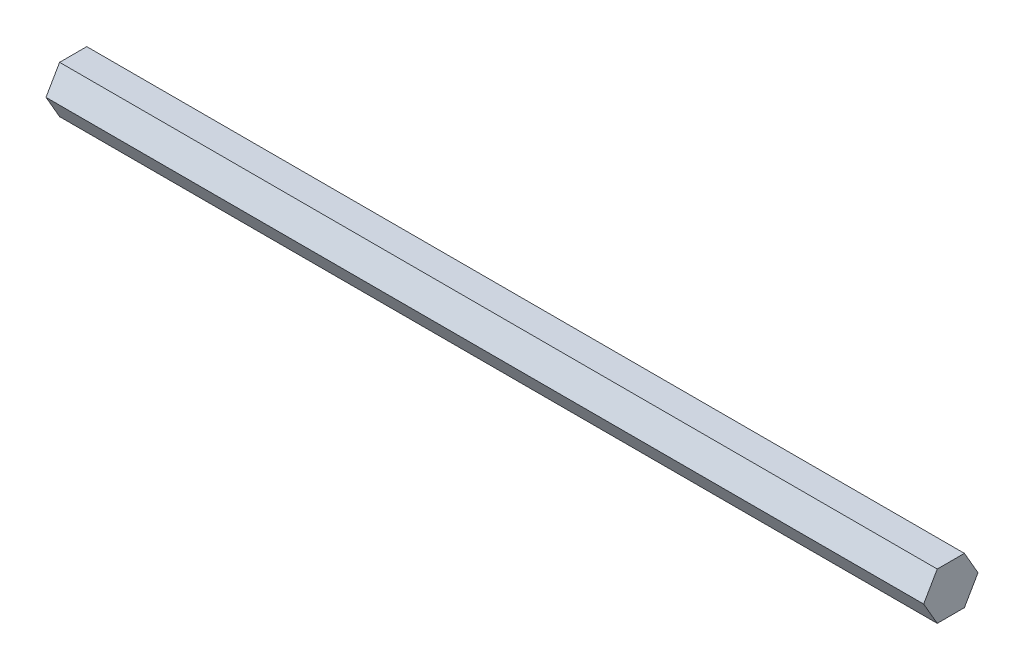
ISO-10303-21;
HEADER;
FILE_DESCRIPTION(('STEP AP214'),'2;1');
FILE_NAME('part.step','',(''),(''),'','','');
FILE_SCHEMA(('AUTOMOTIVE_DESIGN { 1 0 10303 214 1 1 1 1 }'));
ENDSEC;
DATA;
#1=APPLICATION_CONTEXT('core data for automotive mechanical design processes');
#2=APPLICATION_PROTOCOL_DEFINITION('international standard','automotive_design',2000,#1);
#3=PRODUCT_CONTEXT('',#1,'mechanical');
#4=PRODUCT('Part','Part','',(#3));
#5=PRODUCT_RELATED_PRODUCT_CATEGORY('part','',(#4));
#6=PRODUCT_DEFINITION_FORMATION('','',#4);
#7=PRODUCT_DEFINITION_CONTEXT('part definition',#1,'design');
#8=PRODUCT_DEFINITION('design','',#6,#7);
#9=PRODUCT_DEFINITION_SHAPE('','',#8);
#10=(LENGTH_UNIT() NAMED_UNIT(*) SI_UNIT(.MILLI.,.METRE.));
#11=(NAMED_UNIT(*) PLANE_ANGLE_UNIT() SI_UNIT($,.RADIAN.));
#12=(NAMED_UNIT(*) SI_UNIT($,.STERADIAN.) SOLID_ANGLE_UNIT());
#13=UNCERTAINTY_MEASURE_WITH_UNIT(LENGTH_MEASURE(1.E-05),#10,'distance_accuracy_value','');
#14=(GEOMETRIC_REPRESENTATION_CONTEXT(3) GLOBAL_UNCERTAINTY_ASSIGNED_CONTEXT((#13)) GLOBAL_UNIT_ASSIGNED_CONTEXT((#10,
#11,#12)) REPRESENTATION_CONTEXT('',''));
#15=CARTESIAN_POINT('',(0.,0.,0.));
#16=DIRECTION('',(0.,0.,1.));
#17=DIRECTION('',(1.,0.,0.));
#18=AXIS2_PLACEMENT_3D('',#15,#16,#17);
#19=CARTESIAN_POINT('',(236.85,-6.34999999999996,-3.6661742093542));
#20=DIRECTION('',(0.,0.499999999999995,0.866025403784442));
#21=DIRECTION('',(0.,-0.866025403784442,0.499999999999995));
#22=AXIS2_PLACEMENT_3D('',#19,#20,#21);
#23=PLANE('',#22);
#24=DIRECTION('',(0.,0.866025403784442,-0.499999999999995));
#25=VECTOR('',#24,1.);
#26=CARTESIAN_POINT('',(0.,-6.34999999999996,-3.6661742093542));
#27=LINE('',#26,#25);
#28=CARTESIAN_POINT('',(0.,-6.34999999999996,-3.6661742093542));
#29=VERTEX_POINT('',#28);
#30=CARTESIAN_POINT('',(0.,0.,-7.33234841870825));
#31=VERTEX_POINT('',#30);
#32=EDGE_CURVE('E123',#29,#31,#27,.T.);
#33=ORIENTED_EDGE('',*,*,#32,.T.);
#34=DIRECTION('',(-1.,0.,0.));
#35=VECTOR('',#34,1.);
#36=CARTESIAN_POINT('',(236.85,0.,-7.33234841870825));
#37=LINE('',#36,#35);
#38=CARTESIAN_POINT('',(236.85,0.,-7.33234841870825));
#39=VERTEX_POINT('',#38);
#40=EDGE_CURVE('E11',#39,#31,#37,.T.);
#41=ORIENTED_EDGE('',*,*,#40,.F.);
#42=DIRECTION('',(0.,0.866025403784442,-0.499999999999995));
#43=VECTOR('',#42,1.);
#44=CARTESIAN_POINT('',(236.85,-6.34999999999996,-3.6661742093542));
#45=LINE('',#44,#43);
#46=CARTESIAN_POINT('',(236.85,-6.34999999999996,-3.6661742093542));
#47=VERTEX_POINT('',#46);
#48=EDGE_CURVE('E133',#47,#39,#45,.T.);
#49=ORIENTED_EDGE('',*,*,#48,.F.);
#50=DIRECTION('',(-1.,0.,0.));
#51=VECTOR('',#50,1.);
#52=CARTESIAN_POINT('',(236.85,-6.34999999999996,-3.6661742093542));
#53=LINE('',#52,#51);
#54=EDGE_CURVE('E119',#47,#29,#53,.T.);
#55=ORIENTED_EDGE('',*,*,#54,.T.);
#56=EDGE_LOOP('',(#33,#41,#49,#55));
#57=FACE_BOUND('',#56,.T.);
#58=ADVANCED_FACE('F39',(#57),#23,.F.);
#59=CARTESIAN_POINT('',(236.85,0.,-7.33234841870825));
#60=DIRECTION('',(0.,-0.500000000000001,0.866025403784438));
#61=DIRECTION('',(0.,-0.866025403784438,-0.500000000000001));
#62=AXIS2_PLACEMENT_3D('',#59,#60,#61);
#63=PLANE('',#62);
#64=DIRECTION('',(0.,0.866025403784438,0.500000000000001));
#65=VECTOR('',#64,1.);
#66=CARTESIAN_POINT('',(0.,0.,-7.33234841870825));
#67=LINE('',#66,#65);
#68=CARTESIAN_POINT('',(0.,6.35000000000001,-3.66617420935411));
#69=VERTEX_POINT('',#68);
#70=EDGE_CURVE('E126',#31,#69,#67,.T.);
#71=ORIENTED_EDGE('',*,*,#70,.T.);
#72=DIRECTION('',(-1.,0.,0.));
#73=VECTOR('',#72,1.);
#74=CARTESIAN_POINT('',(236.85,6.35000000000001,-3.66617420935411));
#75=LINE('',#74,#73);
#76=CARTESIAN_POINT('',(236.85,6.35000000000001,-3.66617420935411));
#77=VERTEX_POINT('',#76);
#78=EDGE_CURVE('E47',#77,#69,#75,.T.);
#79=ORIENTED_EDGE('',*,*,#78,.F.);
#80=DIRECTION('',(0.,0.866025403784438,0.500000000000001));
#81=VECTOR('',#80,1.);
#82=CARTESIAN_POINT('',(236.85,0.,-7.33234841870825));
#83=LINE('',#82,#81);
#84=EDGE_CURVE('E92',#39,#77,#83,.T.);
#85=ORIENTED_EDGE('',*,*,#84,.F.);
#86=ORIENTED_EDGE('',*,*,#40,.T.);
#87=EDGE_LOOP('',(#71,#79,#85,#86));
#88=FACE_BOUND('',#87,.T.);
#89=ADVANCED_FACE('F157',(#88),#63,.F.);
#90=CARTESIAN_POINT('',(236.85,6.35000000000001,-3.66617420935411));
#91=DIRECTION('',(0.,-1.,0.));
#92=DIRECTION('',(0.,0.,-1.));
#93=AXIS2_PLACEMENT_3D('',#90,#91,#92);
#94=PLANE('',#93);
#95=DIRECTION('',(0.,0.,1.));
#96=VECTOR('',#95,1.);
#97=CARTESIAN_POINT('',(0.,6.35000000000001,-3.66617420935411));
#98=LINE('',#97,#96);
#99=CARTESIAN_POINT('',(0.,6.34999999999999,3.66617420935415));
#100=VERTEX_POINT('',#99);
#101=EDGE_CURVE('E128',#69,#100,#98,.T.);
#102=ORIENTED_EDGE('',*,*,#101,.T.);
#103=DIRECTION('',(-1.,0.,0.));
#104=VECTOR('',#103,1.);
#105=CARTESIAN_POINT('',(236.85,6.34999999999999,3.66617420935415));
#106=LINE('',#105,#104);
#107=CARTESIAN_POINT('',(236.85,6.34999999999999,3.66617420935415));
#108=VERTEX_POINT('',#107);
#109=EDGE_CURVE('E114',#108,#100,#106,.T.);
#110=ORIENTED_EDGE('',*,*,#109,.F.);
#111=DIRECTION('',(0.,0.,1.));
#112=VECTOR('',#111,1.);
#113=CARTESIAN_POINT('',(236.85,6.35000000000001,-3.66617420935411));
#114=LINE('',#113,#112);
#115=EDGE_CURVE('E105',#77,#108,#114,.T.);
#116=ORIENTED_EDGE('',*,*,#115,.F.);
#117=ORIENTED_EDGE('',*,*,#78,.T.);
#118=EDGE_LOOP('',(#102,#110,#116,#117));
#119=FACE_BOUND('',#118,.T.);
#120=ADVANCED_FACE('F139',(#119),#94,.F.);
#121=CARTESIAN_POINT('',(236.85,6.34999999999999,3.66617420935415));
#122=DIRECTION('',(0.,-0.499999999999995,-0.866025403784442));
#123=DIRECTION('',(0.,0.866025403784442,-0.499999999999995));
#124=AXIS2_PLACEMENT_3D('',#121,#122,#123);
#125=PLANE('',#124);
#126=DIRECTION('',(0.,-0.866025403784442,0.499999999999995));
#127=VECTOR('',#126,1.);
#128=CARTESIAN_POINT('',(0.,6.34999999999999,3.66617420935415));
#129=LINE('',#128,#127);
#130=CARTESIAN_POINT('',(0.,0.,7.33234841870825));
#131=VERTEX_POINT('',#130);
#132=EDGE_CURVE('E113',#100,#131,#129,.T.);
#133=ORIENTED_EDGE('',*,*,#132,.T.);
#134=DIRECTION('',(-1.,0.,0.));
#135=VECTOR('',#134,1.);
#136=CARTESIAN_POINT('',(236.85,0.,7.33234841870825));
#137=LINE('',#136,#135);
#138=CARTESIAN_POINT('',(236.85,0.,7.33234841870825));
#139=VERTEX_POINT('',#138);
#140=EDGE_CURVE('E110',#139,#131,#137,.T.);
#141=ORIENTED_EDGE('',*,*,#140,.F.);
#142=DIRECTION('',(0.,-0.866025403784442,0.499999999999995));
#143=VECTOR('',#142,1.);
#144=CARTESIAN_POINT('',(236.85,6.34999999999999,3.66617420935415));
#145=LINE('',#144,#143);
#146=EDGE_CURVE('E99',#108,#139,#145,.T.);
#147=ORIENTED_EDGE('',*,*,#146,.F.);
#148=ORIENTED_EDGE('',*,*,#109,.T.);
#149=EDGE_LOOP('',(#133,#141,#147,#148));
#150=FACE_BOUND('',#149,.T.);
#151=ADVANCED_FACE('F111',(#150),#125,.F.);
#152=CARTESIAN_POINT('',(236.85,0.,7.33234841870825));
#153=DIRECTION('',(0.,0.500000000000007,-0.866025403784435));
#154=DIRECTION('',(0.,0.866025403784435,0.500000000000007));
#155=AXIS2_PLACEMENT_3D('',#152,#153,#154);
#156=PLANE('',#155);
#157=DIRECTION('',(0.,-0.866025403784434,-0.500000000000007));
#158=VECTOR('',#157,1.);
#159=CARTESIAN_POINT('',(0.,0.,7.33234841870825));
#160=LINE('',#159,#158);
#161=CARTESIAN_POINT('',(0.,-6.35000000000004,3.66617420935407));
#162=VERTEX_POINT('',#161);
#163=EDGE_CURVE('E78',#131,#162,#160,.T.);
#164=ORIENTED_EDGE('',*,*,#163,.T.);
#165=DIRECTION('',(-1.,0.,0.));
#166=VECTOR('',#165,1.);
#167=CARTESIAN_POINT('',(236.85,-6.35000000000004,3.66617420935407));
#168=LINE('',#167,#166);
#169=CARTESIAN_POINT('',(236.85,-6.35000000000004,3.66617420935407));
#170=VERTEX_POINT('',#169);
#171=EDGE_CURVE('E115',#170,#162,#168,.T.);
#172=ORIENTED_EDGE('',*,*,#171,.F.);
#173=DIRECTION('',(0.,-0.866025403784434,-0.500000000000007));
#174=VECTOR('',#173,1.);
#175=CARTESIAN_POINT('',(236.85,0.,7.33234841870825));
#176=LINE('',#175,#174);
#177=EDGE_CURVE('E103',#139,#170,#176,.T.);
#178=ORIENTED_EDGE('',*,*,#177,.F.);
#179=ORIENTED_EDGE('',*,*,#140,.T.);
#180=EDGE_LOOP('',(#164,#172,#178,#179));
#181=FACE_BOUND('',#180,.T.);
#182=ADVANCED_FACE('F117',(#181),#156,.F.);
#183=CARTESIAN_POINT('',(236.85,-6.35000000000004,3.66617420935407));
#184=DIRECTION('',(0.,1.,0.));
#185=DIRECTION('',(0.,0.,1.));
#186=AXIS2_PLACEMENT_3D('',#183,#184,#185);
#187=PLANE('',#186);
#188=DIRECTION('',(0.,0.,-1.));
#189=VECTOR('',#188,1.);
#190=CARTESIAN_POINT('',(0.,-6.35000000000004,3.66617420935407));
#191=LINE('',#190,#189);
#192=EDGE_CURVE('E84',#162,#29,#191,.T.);
#193=ORIENTED_EDGE('',*,*,#192,.T.);
#194=ORIENTED_EDGE('',*,*,#54,.F.);
#195=DIRECTION('',(0.,0.,-1.));
#196=VECTOR('',#195,1.);
#197=CARTESIAN_POINT('',(236.85,-6.35000000000004,3.66617420935407));
#198=LINE('',#197,#196);
#199=EDGE_CURVE('E55',#170,#47,#198,.T.);
#200=ORIENTED_EDGE('',*,*,#199,.F.);
#201=ORIENTED_EDGE('',*,*,#171,.T.);
#202=EDGE_LOOP('',(#193,#194,#200,#201));
#203=FACE_BOUND('',#202,.T.);
#204=ADVANCED_FACE('F146',(#203),#187,.F.);
#205=CARTESIAN_POINT('',(236.85,0.,0.));
#206=DIRECTION('',(1.,0.,0.));
#207=DIRECTION('',(0.,0.,-1.));
#208=AXIS2_PLACEMENT_3D('',#205,#206,#207);
#209=PLANE('',#208);
#210=ORIENTED_EDGE('',*,*,#48,.T.);
#211=ORIENTED_EDGE('',*,*,#84,.T.);
#212=ORIENTED_EDGE('',*,*,#115,.T.);
#213=ORIENTED_EDGE('',*,*,#146,.T.);
#214=ORIENTED_EDGE('',*,*,#177,.T.);
#215=ORIENTED_EDGE('',*,*,#199,.T.);
#216=EDGE_LOOP('',(#210,#211,#212,#213,#214,#215));
#217=FACE_BOUND('',#216,.T.);
#218=ADVANCED_FACE('F101',(#217),#209,.T.);
#219=CARTESIAN_POINT('',(0.,0.,0.));
#220=DIRECTION('',(1.,0.,0.));
#221=DIRECTION('',(0.,0.,-1.));
#222=AXIS2_PLACEMENT_3D('',#219,#220,#221);
#223=PLANE('',#222);
#224=ORIENTED_EDGE('',*,*,#32,.F.);
#225=ORIENTED_EDGE('',*,*,#192,.F.);
#226=ORIENTED_EDGE('',*,*,#163,.F.);
#227=ORIENTED_EDGE('',*,*,#132,.F.);
#228=ORIENTED_EDGE('',*,*,#101,.F.);
#229=ORIENTED_EDGE('',*,*,#70,.F.);
#230=EDGE_LOOP('',(#224,#225,#226,#227,#228,#229));
#231=FACE_BOUND('',#230,.T.);
#232=ADVANCED_FACE('F142',(#231),#223,.F.);
#233=CLOSED_SHELL('',(#58,#89,#120,#151,#182,#204,#218,#232));
#234=MANIFOLD_SOLID_BREP('B2',#233);
#235=ADVANCED_BREP_SHAPE_REPRESENTATION('',(#18,#234),#14);
#236=SHAPE_DEFINITION_REPRESENTATION(#9,#235);
ENDSEC;
END-ISO-10303-21;
